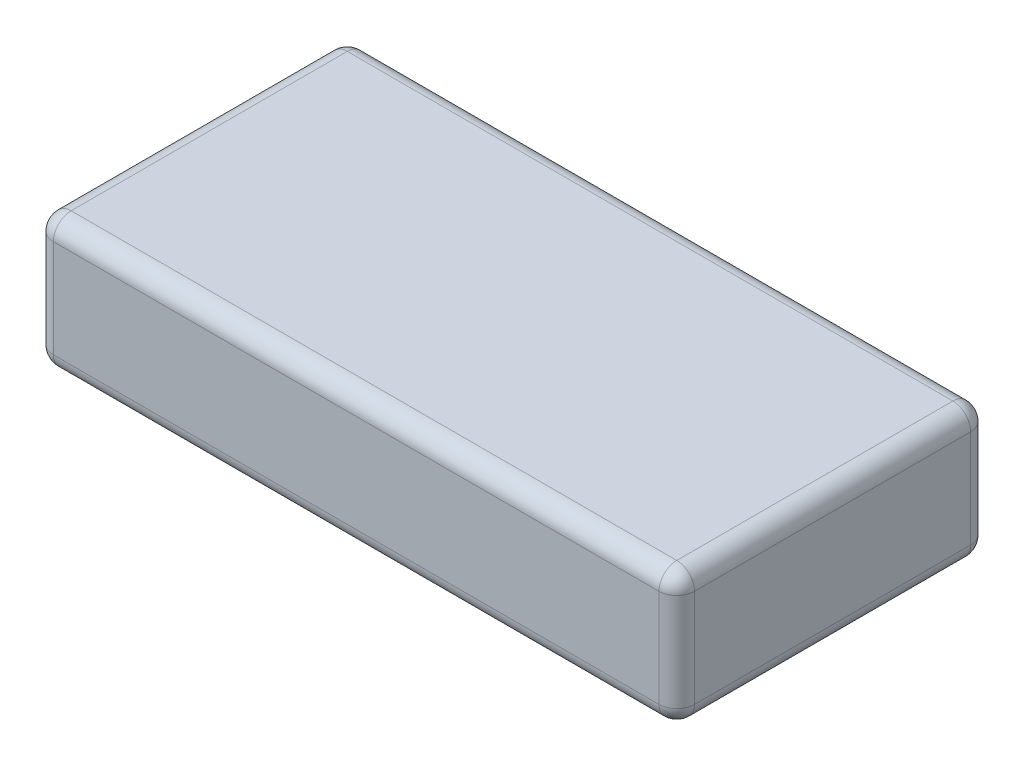
ISO-10303-21;
HEADER;
FILE_DESCRIPTION(('STEP AP214'),'2;1');
FILE_NAME('part.step','',(''),(''),'','','');
FILE_SCHEMA(('AUTOMOTIVE_DESIGN { 1 0 10303 214 1 1 1 1 }'));
ENDSEC;
DATA;
#1=APPLICATION_CONTEXT('core data for automotive mechanical design processes');
#2=APPLICATION_PROTOCOL_DEFINITION('international standard','automotive_design',2000,#1);
#3=PRODUCT_CONTEXT('',#1,'mechanical');
#4=PRODUCT('Part','Part','',(#3));
#5=PRODUCT_RELATED_PRODUCT_CATEGORY('part','',(#4));
#6=PRODUCT_DEFINITION_FORMATION('','',#4);
#7=PRODUCT_DEFINITION_CONTEXT('part definition',#1,'design');
#8=PRODUCT_DEFINITION('design','',#6,#7);
#9=PRODUCT_DEFINITION_SHAPE('','',#8);
#10=(LENGTH_UNIT() NAMED_UNIT(*) SI_UNIT(.MILLI.,.METRE.));
#11=(NAMED_UNIT(*) PLANE_ANGLE_UNIT() SI_UNIT($,.RADIAN.));
#12=(NAMED_UNIT(*) SI_UNIT($,.STERADIAN.) SOLID_ANGLE_UNIT());
#13=UNCERTAINTY_MEASURE_WITH_UNIT(LENGTH_MEASURE(1.E-05),#10,'distance_accuracy_value','');
#14=(GEOMETRIC_REPRESENTATION_CONTEXT(3) GLOBAL_UNCERTAINTY_ASSIGNED_CONTEXT((#13)) GLOBAL_UNIT_ASSIGNED_CONTEXT((#10,
#11,#12)) REPRESENTATION_CONTEXT('',''));
#15=CARTESIAN_POINT('',(0.,0.,0.));
#16=DIRECTION('',(0.,0.,1.));
#17=DIRECTION('',(1.,0.,0.));
#18=AXIS2_PLACEMENT_3D('',#15,#16,#17);
#19=CARTESIAN_POINT('',(-36.,15.,-17.5));
#20=DIRECTION('',(1.,0.,0.));
#21=DIRECTION('',(0.,0.,-1.));
#22=AXIS2_PLACEMENT_3D('',#19,#20,#21);
#23=PLANE('',#22);
#24=DIRECTION('',(0.,-1.,0.));
#25=VECTOR('',#24,1.);
#26=CARTESIAN_POINT('',(-36.,15.,-15.5));
#27=LINE('',#26,#25);
#28=CARTESIAN_POINT('',(-36.,13.,-15.5));
#29=VERTEX_POINT('',#28);
#30=CARTESIAN_POINT('',(-36.,2.,-15.5));
#31=VERTEX_POINT('',#30);
#32=EDGE_CURVE('E130',#29,#31,#27,.T.);
#33=ORIENTED_EDGE('',*,*,#32,.T.);
#34=DIRECTION('',(0.,0.,1.));
#35=VECTOR('',#34,1.);
#36=CARTESIAN_POINT('',(-36.,2.,17.5));
#37=LINE('',#36,#35);
#38=CARTESIAN_POINT('',(-36.,2.,15.5));
#39=VERTEX_POINT('',#38);
#40=EDGE_CURVE('E126',#31,#39,#37,.T.);
#41=ORIENTED_EDGE('',*,*,#40,.T.);
#42=DIRECTION('',(0.,-1.,0.));
#43=VECTOR('',#42,1.);
#44=CARTESIAN_POINT('',(-36.,15.,15.5));
#45=LINE('',#44,#43);
#46=CARTESIAN_POINT('',(-36.,13.,15.5));
#47=VERTEX_POINT('',#46);
#48=EDGE_CURVE('E121',#39,#47,#45,.F.);
#49=ORIENTED_EDGE('',*,*,#48,.T.);
#50=DIRECTION('',(0.,0.,1.));
#51=VECTOR('',#50,1.);
#52=CARTESIAN_POINT('',(-36.,13.,-17.5));
#53=LINE('',#52,#51);
#54=EDGE_CURVE('E123',#47,#29,#53,.F.);
#55=ORIENTED_EDGE('',*,*,#54,.T.);
#56=EDGE_LOOP('',(#33,#41,#49,#55));
#57=FACE_BOUND('',#56,.T.);
#58=ADVANCED_FACE('F33',(#57),#23,.F.);
#59=CARTESIAN_POINT('',(36.,15.,17.5));
#60=DIRECTION('',(0.,0.,-1.));
#61=DIRECTION('',(-1.,0.,0.));
#62=AXIS2_PLACEMENT_3D('',#59,#60,#61);
#63=PLANE('',#62);
#64=DIRECTION('',(0.,-1.,0.));
#65=VECTOR('',#64,1.);
#66=CARTESIAN_POINT('',(-34.,15.,17.5));
#67=LINE('',#66,#65);
#68=CARTESIAN_POINT('',(-34.,13.,17.5));
#69=VERTEX_POINT('',#68);
#70=CARTESIAN_POINT('',(-34.,2.,17.5));
#71=VERTEX_POINT('',#70);
#72=EDGE_CURVE('E152',#69,#71,#67,.T.);
#73=ORIENTED_EDGE('',*,*,#72,.T.);
#74=DIRECTION('',(1.,0.,0.));
#75=VECTOR('',#74,1.);
#76=CARTESIAN_POINT('',(36.,2.,17.5));
#77=LINE('',#76,#75);
#78=CARTESIAN_POINT('',(34.,2.,17.5));
#79=VERTEX_POINT('',#78);
#80=EDGE_CURVE('E230',#71,#79,#77,.T.);
#81=ORIENTED_EDGE('',*,*,#80,.T.);
#82=DIRECTION('',(0.,-1.,0.));
#83=VECTOR('',#82,1.);
#84=CARTESIAN_POINT('',(34.,15.,17.5));
#85=LINE('',#84,#83);
#86=CARTESIAN_POINT('',(34.,13.,17.5));
#87=VERTEX_POINT('',#86);
#88=EDGE_CURVE('E223',#79,#87,#85,.F.);
#89=ORIENTED_EDGE('',*,*,#88,.T.);
#90=DIRECTION('',(1.,0.,0.));
#91=VECTOR('',#90,1.);
#92=CARTESIAN_POINT('',(36.,13.,17.5));
#93=LINE('',#92,#91);
#94=EDGE_CURVE('E221',#87,#69,#93,.F.);
#95=ORIENTED_EDGE('',*,*,#94,.T.);
#96=EDGE_LOOP('',(#73,#81,#89,#95));
#97=FACE_BOUND('',#96,.T.);
#98=ADVANCED_FACE('F320',(#97),#63,.F.);
#99=CARTESIAN_POINT('',(36.,15.,-17.5));
#100=DIRECTION('',(-1.,0.,0.));
#101=DIRECTION('',(0.,0.,1.));
#102=AXIS2_PLACEMENT_3D('',#99,#100,#101);
#103=PLANE('',#102);
#104=DIRECTION('',(0.,0.,-1.));
#105=VECTOR('',#104,1.);
#106=CARTESIAN_POINT('',(36.,2.,-17.5));
#107=LINE('',#106,#105);
#108=CARTESIAN_POINT('',(36.,2.,15.5));
#109=VERTEX_POINT('',#108);
#110=CARTESIAN_POINT('',(36.,2.,-15.5));
#111=VERTEX_POINT('',#110);
#112=EDGE_CURVE('E217',#109,#111,#107,.T.);
#113=ORIENTED_EDGE('',*,*,#112,.T.);
#114=DIRECTION('',(0.,-1.,0.));
#115=VECTOR('',#114,1.);
#116=CARTESIAN_POINT('',(36.,15.,-15.5));
#117=LINE('',#116,#115);
#118=CARTESIAN_POINT('',(36.,13.,-15.5));
#119=VERTEX_POINT('',#118);
#120=EDGE_CURVE('E214',#111,#119,#117,.F.);
#121=ORIENTED_EDGE('',*,*,#120,.T.);
#122=DIRECTION('',(0.,0.,-1.));
#123=VECTOR('',#122,1.);
#124=CARTESIAN_POINT('',(36.,13.,-17.5));
#125=LINE('',#124,#123);
#126=CARTESIAN_POINT('',(36.,13.,15.5));
#127=VERTEX_POINT('',#126);
#128=EDGE_CURVE('E207',#119,#127,#125,.F.);
#129=ORIENTED_EDGE('',*,*,#128,.T.);
#130=DIRECTION('',(0.,-1.,0.));
#131=VECTOR('',#130,1.);
#132=CARTESIAN_POINT('',(36.,15.,15.5));
#133=LINE('',#132,#131);
#134=EDGE_CURVE('E210',#127,#109,#133,.T.);
#135=ORIENTED_EDGE('',*,*,#134,.T.);
#136=EDGE_LOOP('',(#113,#121,#129,#135));
#137=FACE_BOUND('',#136,.T.);
#138=ADVANCED_FACE('F215',(#137),#103,.F.);
#139=CARTESIAN_POINT('',(36.,15.,-17.5));
#140=DIRECTION('',(0.,0.,1.));
#141=DIRECTION('',(1.,0.,0.));
#142=AXIS2_PLACEMENT_3D('',#139,#140,#141);
#143=PLANE('',#142);
#144=DIRECTION('',(-1.,0.,0.));
#145=VECTOR('',#144,1.);
#146=CARTESIAN_POINT('',(-36.,2.,-17.5));
#147=LINE('',#146,#145);
#148=CARTESIAN_POINT('',(34.,2.,-17.5));
#149=VERTEX_POINT('',#148);
#150=CARTESIAN_POINT('',(-34.,2.,-17.5));
#151=VERTEX_POINT('',#150);
#152=EDGE_CURVE('E279',#149,#151,#147,.T.);
#153=ORIENTED_EDGE('',*,*,#152,.T.);
#154=DIRECTION('',(0.,-1.,0.));
#155=VECTOR('',#154,1.);
#156=CARTESIAN_POINT('',(-34.,15.,-17.5));
#157=LINE('',#156,#155);
#158=CARTESIAN_POINT('',(-34.,13.,-17.5));
#159=VERTEX_POINT('',#158);
#160=EDGE_CURVE('E211',#151,#159,#157,.F.);
#161=ORIENTED_EDGE('',*,*,#160,.T.);
#162=DIRECTION('',(-1.,0.,0.));
#163=VECTOR('',#162,1.);
#164=CARTESIAN_POINT('',(36.,13.,-17.5));
#165=LINE('',#164,#163);
#166=CARTESIAN_POINT('',(34.,13.,-17.5));
#167=VERTEX_POINT('',#166);
#168=EDGE_CURVE('E272',#159,#167,#165,.F.);
#169=ORIENTED_EDGE('',*,*,#168,.T.);
#170=DIRECTION('',(0.,-1.,0.));
#171=VECTOR('',#170,1.);
#172=CARTESIAN_POINT('',(34.,15.,-17.5));
#173=LINE('',#172,#171);
#174=EDGE_CURVE('E274',#167,#149,#173,.T.);
#175=ORIENTED_EDGE('',*,*,#174,.T.);
#176=EDGE_LOOP('',(#153,#161,#169,#175));
#177=FACE_BOUND('',#176,.T.);
#178=ADVANCED_FACE('F304',(#177),#143,.F.);
#179=CARTESIAN_POINT('',(0.,15.,0.));
#180=DIRECTION('',(0.,-1.,0.));
#181=DIRECTION('',(0.,0.,-1.));
#182=AXIS2_PLACEMENT_3D('',#179,#180,#181);
#183=PLANE('',#182);
#184=DIRECTION('',(0.,0.,-1.));
#185=VECTOR('',#184,1.);
#186=CARTESIAN_POINT('',(34.,15.,0.));
#187=LINE('',#186,#185);
#188=CARTESIAN_POINT('',(34.,15.,15.5));
#189=VERTEX_POINT('',#188);
#190=CARTESIAN_POINT('',(34.,15.,-15.5));
#191=VERTEX_POINT('',#190);
#192=EDGE_CURVE('E42',#189,#191,#187,.T.);
#193=ORIENTED_EDGE('',*,*,#192,.T.);
#194=DIRECTION('',(-1.,0.,0.));
#195=VECTOR('',#194,1.);
#196=CARTESIAN_POINT('',(0.,15.,-15.5));
#197=LINE('',#196,#195);
#198=CARTESIAN_POINT('',(-34.,15.,-15.5));
#199=VERTEX_POINT('',#198);
#200=EDGE_CURVE('E11',#191,#199,#197,.T.);
#201=ORIENTED_EDGE('',*,*,#200,.T.);
#202=DIRECTION('',(0.,0.,1.));
#203=VECTOR('',#202,1.);
#204=CARTESIAN_POINT('',(-34.,15.,0.));
#205=LINE('',#204,#203);
#206=CARTESIAN_POINT('',(-34.,15.,15.5));
#207=VERTEX_POINT('',#206);
#208=EDGE_CURVE('E232',#199,#207,#205,.T.);
#209=ORIENTED_EDGE('',*,*,#208,.T.);
#210=DIRECTION('',(1.,0.,0.));
#211=VECTOR('',#210,1.);
#212=CARTESIAN_POINT('',(0.,15.,15.5));
#213=LINE('',#212,#211);
#214=EDGE_CURVE('E53',#207,#189,#213,.T.);
#215=ORIENTED_EDGE('',*,*,#214,.T.);
#216=EDGE_LOOP('',(#193,#201,#209,#215));
#217=FACE_BOUND('',#216,.T.);
#218=ADVANCED_FACE('F483',(#217),#183,.F.);
#219=CARTESIAN_POINT('',(0.,0.,0.));
#220=DIRECTION('',(0.,-1.,0.));
#221=DIRECTION('',(0.,0.,-1.));
#222=AXIS2_PLACEMENT_3D('',#219,#220,#221);
#223=PLANE('',#222);
#224=DIRECTION('',(1.,0.,0.));
#225=VECTOR('',#224,1.);
#226=CARTESIAN_POINT('',(-36.,0.,15.5));
#227=LINE('',#226,#225);
#228=CARTESIAN_POINT('',(34.,0.,15.5));
#229=VERTEX_POINT('',#228);
#230=CARTESIAN_POINT('',(-34.,0.,15.5));
#231=VERTEX_POINT('',#230);
#232=EDGE_CURVE('E268',#229,#231,#227,.F.);
#233=ORIENTED_EDGE('',*,*,#232,.T.);
#234=DIRECTION('',(0.,0.,1.));
#235=VECTOR('',#234,1.);
#236=CARTESIAN_POINT('',(-34.,0.,-17.5));
#237=LINE('',#236,#235);
#238=CARTESIAN_POINT('',(-34.,0.,-15.5));
#239=VERTEX_POINT('',#238);
#240=EDGE_CURVE('E262',#231,#239,#237,.F.);
#241=ORIENTED_EDGE('',*,*,#240,.T.);
#242=DIRECTION('',(-1.,0.,0.));
#243=VECTOR('',#242,1.);
#244=CARTESIAN_POINT('',(36.,0.,-15.5));
#245=LINE('',#244,#243);
#246=CARTESIAN_POINT('',(34.,0.,-15.5));
#247=VERTEX_POINT('',#246);
#248=EDGE_CURVE('E256',#239,#247,#245,.F.);
#249=ORIENTED_EDGE('',*,*,#248,.T.);
#250=DIRECTION('',(0.,0.,-1.));
#251=VECTOR('',#250,1.);
#252=CARTESIAN_POINT('',(34.,0.,17.5));
#253=LINE('',#252,#251);
#254=EDGE_CURVE('E263',#247,#229,#253,.F.);
#255=ORIENTED_EDGE('',*,*,#254,.T.);
#256=EDGE_LOOP('',(#233,#241,#249,#255));
#257=FACE_BOUND('',#256,.T.);
#258=ADVANCED_FACE('F266',(#257),#223,.T.);
#259=CARTESIAN_POINT('',(34.,13.,0.));
#260=DIRECTION('',(0.,0.,-1.));
#261=DIRECTION('',(-1.,0.,0.));
#262=AXIS2_PLACEMENT_3D('',#259,#260,#261);
#263=CYLINDRICAL_SURFACE('',#262,2.);
#264=CARTESIAN_POINT('',(34.,13.,-15.5));
#265=DIRECTION('',(0.,0.,-1.));
#266=DIRECTION('',(-1.,0.,0.));
#267=AXIS2_PLACEMENT_3D('',#264,#265,#266);
#268=CIRCLE('',#267,2.);
#269=EDGE_CURVE('E37',#191,#119,#268,.T.);
#270=ORIENTED_EDGE('',*,*,#269,.F.);
#271=ORIENTED_EDGE('',*,*,#192,.F.);
#272=CARTESIAN_POINT('',(34.,13.,15.5));
#273=DIRECTION('',(0.,0.,1.));
#274=DIRECTION('',(0.,-1.,0.));
#275=AXIS2_PLACEMENT_3D('',#272,#273,#274);
#276=CIRCLE('',#275,2.);
#277=EDGE_CURVE('E192',#127,#189,#276,.T.);
#278=ORIENTED_EDGE('',*,*,#277,.F.);
#279=ORIENTED_EDGE('',*,*,#128,.F.);
#280=EDGE_LOOP('',(#270,#271,#278,#279));
#281=FACE_BOUND('',#280,.T.);
#282=ADVANCED_FACE('F35',(#281),#263,.T.);
#283=CARTESIAN_POINT('',(34.,13.,-15.5));
#284=DIRECTION('',(0.,0.,1.));
#285=DIRECTION('',(1.,0.,0.));
#286=AXIS2_PLACEMENT_3D('',#283,#284,#285);
#287=SPHERICAL_SURFACE('',#286,2.);
#288=CARTESIAN_POINT('',(34.,13.,-15.5));
#289=DIRECTION('',(1.,0.,0.));
#290=DIRECTION('',(0.,0.,-1.));
#291=AXIS2_PLACEMENT_3D('',#288,#289,#290);
#292=CIRCLE('',#291,2.);
#293=EDGE_CURVE('E188',#191,#167,#292,.F.);
#294=ORIENTED_EDGE('',*,*,#293,.F.);
#295=ORIENTED_EDGE('',*,*,#269,.T.);
#296=CARTESIAN_POINT('',(34.,13.,-15.5));
#297=DIRECTION('',(0.,1.,0.));
#298=DIRECTION('',(0.,0.,1.));
#299=AXIS2_PLACEMENT_3D('',#296,#297,#298);
#300=CIRCLE('',#299,2.);
#301=EDGE_CURVE('E191',#167,#119,#300,.F.);
#302=ORIENTED_EDGE('',*,*,#301,.F.);
#303=EDGE_LOOP('',(#294,#295,#302));
#304=FACE_BOUND('',#303,.T.);
#305=ADVANCED_FACE('F203',(#304),#287,.T.);
#306=CARTESIAN_POINT('',(34.,13.,15.5));
#307=DIRECTION('',(0.,0.,1.));
#308=DIRECTION('',(1.,0.,0.));
#309=AXIS2_PLACEMENT_3D('',#306,#307,#308);
#310=SPHERICAL_SURFACE('',#309,2.);
#311=CARTESIAN_POINT('',(34.,13.,15.5));
#312=DIRECTION('',(0.,1.,0.));
#313=DIRECTION('',(0.,0.,1.));
#314=AXIS2_PLACEMENT_3D('',#311,#312,#313);
#315=CIRCLE('',#314,2.);
#316=EDGE_CURVE('E182',#127,#87,#315,.F.);
#317=ORIENTED_EDGE('',*,*,#316,.F.);
#318=ORIENTED_EDGE('',*,*,#277,.T.);
#319=CARTESIAN_POINT('',(34.,13.,15.5));
#320=DIRECTION('',(1.,0.,0.));
#321=DIRECTION('',(0.,0.,-1.));
#322=AXIS2_PLACEMENT_3D('',#319,#320,#321);
#323=CIRCLE('',#322,2.);
#324=EDGE_CURVE('E185',#87,#189,#323,.F.);
#325=ORIENTED_EDGE('',*,*,#324,.F.);
#326=EDGE_LOOP('',(#317,#318,#325));
#327=FACE_BOUND('',#326,.T.);
#328=ADVANCED_FACE('F456',(#327),#310,.T.);
#329=CARTESIAN_POINT('',(34.,15.,-15.5));
#330=DIRECTION('',(0.,-1.,0.));
#331=DIRECTION('',(0.,0.,-1.));
#332=AXIS2_PLACEMENT_3D('',#329,#330,#331);
#333=CYLINDRICAL_SURFACE('',#332,2.);
#334=ORIENTED_EDGE('',*,*,#301,.T.);
#335=ORIENTED_EDGE('',*,*,#120,.F.);
#336=CARTESIAN_POINT('',(34.,2.,-15.5));
#337=DIRECTION('',(0.,-1.,0.));
#338=DIRECTION('',(0.,0.,-1.));
#339=AXIS2_PLACEMENT_3D('',#336,#337,#338);
#340=CIRCLE('',#339,2.);
#341=EDGE_CURVE('E176',#149,#111,#340,.T.);
#342=ORIENTED_EDGE('',*,*,#341,.F.);
#343=ORIENTED_EDGE('',*,*,#174,.F.);
#344=EDGE_LOOP('',(#334,#335,#342,#343));
#345=FACE_BOUND('',#344,.T.);
#346=ADVANCED_FACE('F306',(#345),#333,.T.);
#347=CARTESIAN_POINT('',(0.,13.,-15.5));
#348=DIRECTION('',(-1.,0.,0.));
#349=DIRECTION('',(0.,0.,1.));
#350=AXIS2_PLACEMENT_3D('',#347,#348,#349);
#351=CYLINDRICAL_SURFACE('',#350,2.);
#352=ORIENTED_EDGE('',*,*,#293,.T.);
#353=ORIENTED_EDGE('',*,*,#168,.F.);
#354=CARTESIAN_POINT('',(-34.,13.,-15.5));
#355=DIRECTION('',(-1.,0.,0.));
#356=DIRECTION('',(0.,0.,1.));
#357=AXIS2_PLACEMENT_3D('',#354,#355,#356);
#358=CIRCLE('',#357,2.);
#359=EDGE_CURVE('E173',#199,#159,#358,.T.);
#360=ORIENTED_EDGE('',*,*,#359,.F.);
#361=ORIENTED_EDGE('',*,*,#200,.F.);
#362=EDGE_LOOP('',(#352,#353,#360,#361));
#363=FACE_BOUND('',#362,.T.);
#364=ADVANCED_FACE('F440',(#363),#351,.T.);
#365=CARTESIAN_POINT('',(-34.,13.,0.));
#366=DIRECTION('',(0.,0.,1.));
#367=DIRECTION('',(1.,0.,0.));
#368=AXIS2_PLACEMENT_3D('',#365,#366,#367);
#369=CYLINDRICAL_SURFACE('',#368,2.);
#370=CARTESIAN_POINT('',(-34.,13.,15.5));
#371=DIRECTION('',(0.,0.,1.));
#372=DIRECTION('',(1.,0.,0.));
#373=AXIS2_PLACEMENT_3D('',#370,#371,#372);
#374=CIRCLE('',#373,2.);
#375=EDGE_CURVE('E137',#207,#47,#374,.T.);
#376=ORIENTED_EDGE('',*,*,#375,.F.);
#377=ORIENTED_EDGE('',*,*,#208,.F.);
#378=CARTESIAN_POINT('',(-34.,13.,-15.5));
#379=DIRECTION('',(0.,0.,-1.));
#380=DIRECTION('',(-1.,0.,0.));
#381=AXIS2_PLACEMENT_3D('',#378,#379,#380);
#382=CIRCLE('',#381,2.);
#383=EDGE_CURVE('E139',#29,#199,#382,.T.);
#384=ORIENTED_EDGE('',*,*,#383,.F.);
#385=ORIENTED_EDGE('',*,*,#54,.F.);
#386=EDGE_LOOP('',(#376,#377,#384,#385));
#387=FACE_BOUND('',#386,.T.);
#388=ADVANCED_FACE('F135',(#387),#369,.T.);
#389=CARTESIAN_POINT('',(0.,13.,15.5));
#390=DIRECTION('',(1.,0.,0.));
#391=DIRECTION('',(0.,0.,-1.));
#392=AXIS2_PLACEMENT_3D('',#389,#390,#391);
#393=CYLINDRICAL_SURFACE('',#392,2.);
#394=ORIENTED_EDGE('',*,*,#324,.T.);
#395=ORIENTED_EDGE('',*,*,#214,.F.);
#396=CARTESIAN_POINT('',(-34.,13.,15.5));
#397=DIRECTION('',(-1.,0.,0.));
#398=DIRECTION('',(0.,0.,1.));
#399=AXIS2_PLACEMENT_3D('',#396,#397,#398);
#400=CIRCLE('',#399,2.);
#401=EDGE_CURVE('E148',#69,#207,#400,.T.);
#402=ORIENTED_EDGE('',*,*,#401,.F.);
#403=ORIENTED_EDGE('',*,*,#94,.F.);
#404=EDGE_LOOP('',(#394,#395,#402,#403));
#405=FACE_BOUND('',#404,.T.);
#406=ADVANCED_FACE('F424',(#405),#393,.T.);
#407=CARTESIAN_POINT('',(34.,15.,15.5));
#408=DIRECTION('',(0.,-1.,0.));
#409=DIRECTION('',(0.,0.,-1.));
#410=AXIS2_PLACEMENT_3D('',#407,#408,#409);
#411=CYLINDRICAL_SURFACE('',#410,2.);
#412=ORIENTED_EDGE('',*,*,#316,.T.);
#413=ORIENTED_EDGE('',*,*,#88,.F.);
#414=CARTESIAN_POINT('',(34.,2.,15.5));
#415=DIRECTION('',(0.,-1.,0.));
#416=DIRECTION('',(0.,0.,-1.));
#417=AXIS2_PLACEMENT_3D('',#414,#415,#416);
#418=CIRCLE('',#417,2.);
#419=EDGE_CURVE('E168',#109,#79,#418,.T.);
#420=ORIENTED_EDGE('',*,*,#419,.F.);
#421=ORIENTED_EDGE('',*,*,#134,.F.);
#422=EDGE_LOOP('',(#412,#413,#420,#421));
#423=FACE_BOUND('',#422,.T.);
#424=ADVANCED_FACE('F290',(#423),#411,.T.);
#425=CARTESIAN_POINT('',(34.,2.,-17.5));
#426=DIRECTION('',(0.,0.,1.));
#427=DIRECTION('',(1.,0.,0.));
#428=AXIS2_PLACEMENT_3D('',#425,#426,#427);
#429=CYLINDRICAL_SURFACE('',#428,2.);
#430=CARTESIAN_POINT('',(34.,2.,-15.5));
#431=DIRECTION('',(0.,0.,-1.));
#432=DIRECTION('',(-1.,0.,0.));
#433=AXIS2_PLACEMENT_3D('',#430,#431,#432);
#434=CIRCLE('',#433,2.);
#435=EDGE_CURVE('E179',#111,#247,#434,.T.);
#436=ORIENTED_EDGE('',*,*,#435,.F.);
#437=ORIENTED_EDGE('',*,*,#112,.F.);
#438=CARTESIAN_POINT('',(34.,2.,15.5));
#439=DIRECTION('',(0.,0.,1.));
#440=DIRECTION('',(1.,0.,0.));
#441=AXIS2_PLACEMENT_3D('',#438,#439,#440);
#442=CIRCLE('',#441,2.);
#443=EDGE_CURVE('E165',#229,#109,#442,.T.);
#444=ORIENTED_EDGE('',*,*,#443,.F.);
#445=ORIENTED_EDGE('',*,*,#254,.F.);
#446=EDGE_LOOP('',(#436,#437,#444,#445));
#447=FACE_BOUND('',#446,.T.);
#448=ADVANCED_FACE('F287',(#447),#429,.T.);
#449=CARTESIAN_POINT('',(34.,2.,-15.5));
#450=DIRECTION('',(0.,0.,1.));
#451=DIRECTION('',(1.,0.,0.));
#452=AXIS2_PLACEMENT_3D('',#449,#450,#451);
#453=SPHERICAL_SURFACE('',#452,2.);
#454=ORIENTED_EDGE('',*,*,#341,.T.);
#455=ORIENTED_EDGE('',*,*,#435,.T.);
#456=CARTESIAN_POINT('',(34.,2.,-15.5));
#457=DIRECTION('',(1.,0.,0.));
#458=DIRECTION('',(0.,0.,-1.));
#459=AXIS2_PLACEMENT_3D('',#456,#457,#458);
#460=CIRCLE('',#459,2.);
#461=EDGE_CURVE('E156',#149,#247,#460,.F.);
#462=ORIENTED_EDGE('',*,*,#461,.F.);
#463=EDGE_LOOP('',(#454,#455,#462));
#464=FACE_BOUND('',#463,.T.);
#465=ADVANCED_FACE('F308',(#464),#453,.T.);
#466=CARTESIAN_POINT('',(-34.,13.,-15.5));
#467=DIRECTION('',(0.,0.,1.));
#468=DIRECTION('',(1.,0.,0.));
#469=AXIS2_PLACEMENT_3D('',#466,#467,#468);
#470=SPHERICAL_SURFACE('',#469,2.);
#471=ORIENTED_EDGE('',*,*,#383,.T.);
#472=ORIENTED_EDGE('',*,*,#359,.T.);
#473=CARTESIAN_POINT('',(-34.,13.,-15.5));
#474=DIRECTION('',(0.,1.,0.));
#475=DIRECTION('',(0.,0.,1.));
#476=AXIS2_PLACEMENT_3D('',#473,#474,#475);
#477=CIRCLE('',#476,2.);
#478=EDGE_CURVE('E153',#29,#159,#477,.F.);
#479=ORIENTED_EDGE('',*,*,#478,.F.);
#480=EDGE_LOOP('',(#471,#472,#479));
#481=FACE_BOUND('',#480,.T.);
#482=ADVANCED_FACE('F310',(#481),#470,.T.);
#483=CARTESIAN_POINT('',(-34.,13.,15.5));
#484=DIRECTION('',(0.,0.,1.));
#485=DIRECTION('',(1.,0.,0.));
#486=AXIS2_PLACEMENT_3D('',#483,#484,#485);
#487=SPHERICAL_SURFACE('',#486,2.);
#488=ORIENTED_EDGE('',*,*,#401,.T.);
#489=ORIENTED_EDGE('',*,*,#375,.T.);
#490=CARTESIAN_POINT('',(-34.,13.,15.5));
#491=DIRECTION('',(0.,1.,0.));
#492=DIRECTION('',(0.,0.,1.));
#493=AXIS2_PLACEMENT_3D('',#490,#491,#492);
#494=CIRCLE('',#493,2.);
#495=EDGE_CURVE('E145',#69,#47,#494,.F.);
#496=ORIENTED_EDGE('',*,*,#495,.F.);
#497=EDGE_LOOP('',(#488,#489,#496));
#498=FACE_BOUND('',#497,.T.);
#499=ADVANCED_FACE('F144',(#498),#487,.T.);
#500=CARTESIAN_POINT('',(34.,2.,15.5));
#501=DIRECTION('',(0.,0.,1.));
#502=DIRECTION('',(1.,0.,0.));
#503=AXIS2_PLACEMENT_3D('',#500,#501,#502);
#504=SPHERICAL_SURFACE('',#503,2.);
#505=ORIENTED_EDGE('',*,*,#443,.T.);
#506=ORIENTED_EDGE('',*,*,#419,.T.);
#507=CARTESIAN_POINT('',(34.,2.,15.5));
#508=DIRECTION('',(1.,0.,0.));
#509=DIRECTION('',(0.,0.,-1.));
#510=AXIS2_PLACEMENT_3D('',#507,#508,#509);
#511=CIRCLE('',#510,2.);
#512=EDGE_CURVE('E154',#229,#79,#511,.F.);
#513=ORIENTED_EDGE('',*,*,#512,.F.);
#514=EDGE_LOOP('',(#505,#506,#513));
#515=FACE_BOUND('',#514,.T.);
#516=ADVANCED_FACE('F292',(#515),#504,.T.);
#517=CARTESIAN_POINT('',(36.,2.,-15.5));
#518=DIRECTION('',(1.,0.,0.));
#519=DIRECTION('',(0.,0.,-1.));
#520=AXIS2_PLACEMENT_3D('',#517,#518,#519);
#521=CYLINDRICAL_SURFACE('',#520,2.);
#522=ORIENTED_EDGE('',*,*,#461,.T.);
#523=ORIENTED_EDGE('',*,*,#248,.F.);
#524=CARTESIAN_POINT('',(-34.,2.,-15.5));
#525=DIRECTION('',(-1.,0.,0.));
#526=DIRECTION('',(0.,0.,1.));
#527=AXIS2_PLACEMENT_3D('',#524,#525,#526);
#528=CIRCLE('',#527,2.);
#529=EDGE_CURVE('E159',#151,#239,#528,.T.);
#530=ORIENTED_EDGE('',*,*,#529,.F.);
#531=ORIENTED_EDGE('',*,*,#152,.F.);
#532=EDGE_LOOP('',(#522,#523,#530,#531));
#533=FACE_BOUND('',#532,.T.);
#534=ADVANCED_FACE('F258',(#533),#521,.T.);
#535=CARTESIAN_POINT('',(-34.,15.,-15.5));
#536=DIRECTION('',(0.,-1.,0.));
#537=DIRECTION('',(0.,0.,-1.));
#538=AXIS2_PLACEMENT_3D('',#535,#536,#537);
#539=CYLINDRICAL_SURFACE('',#538,2.);
#540=ORIENTED_EDGE('',*,*,#478,.T.);
#541=ORIENTED_EDGE('',*,*,#160,.F.);
#542=CARTESIAN_POINT('',(-34.,2.,-15.5));
#543=DIRECTION('',(0.,-1.,0.));
#544=DIRECTION('',(0.,0.,-1.));
#545=AXIS2_PLACEMENT_3D('',#542,#543,#544);
#546=CIRCLE('',#545,2.);
#547=EDGE_CURVE('E245',#31,#151,#546,.T.);
#548=ORIENTED_EDGE('',*,*,#547,.F.);
#549=ORIENTED_EDGE('',*,*,#32,.F.);
#550=EDGE_LOOP('',(#540,#541,#548,#549));
#551=FACE_BOUND('',#550,.T.);
#552=ADVANCED_FACE('F302',(#551),#539,.T.);
#553=CARTESIAN_POINT('',(-34.,15.,15.5));
#554=DIRECTION('',(0.,-1.,0.));
#555=DIRECTION('',(0.,0.,-1.));
#556=AXIS2_PLACEMENT_3D('',#553,#554,#555);
#557=CYLINDRICAL_SURFACE('',#556,2.);
#558=ORIENTED_EDGE('',*,*,#495,.T.);
#559=ORIENTED_EDGE('',*,*,#48,.F.);
#560=CARTESIAN_POINT('',(-34.,2.,15.5));
#561=DIRECTION('',(0.,-1.,0.));
#562=DIRECTION('',(0.,0.,-1.));
#563=AXIS2_PLACEMENT_3D('',#560,#561,#562);
#564=CIRCLE('',#563,2.);
#565=EDGE_CURVE('E242',#71,#39,#564,.T.);
#566=ORIENTED_EDGE('',*,*,#565,.F.);
#567=ORIENTED_EDGE('',*,*,#72,.F.);
#568=EDGE_LOOP('',(#558,#559,#566,#567));
#569=FACE_BOUND('',#568,.T.);
#570=ADVANCED_FACE('F150',(#569),#557,.T.);
#571=CARTESIAN_POINT('',(36.,2.,15.5));
#572=DIRECTION('',(-1.,0.,0.));
#573=DIRECTION('',(0.,0.,1.));
#574=AXIS2_PLACEMENT_3D('',#571,#572,#573);
#575=CYLINDRICAL_SURFACE('',#574,2.);
#576=ORIENTED_EDGE('',*,*,#512,.T.);
#577=ORIENTED_EDGE('',*,*,#80,.F.);
#578=CARTESIAN_POINT('',(-34.,2.,15.5));
#579=DIRECTION('',(-1.,0.,0.));
#580=DIRECTION('',(0.,0.,1.));
#581=AXIS2_PLACEMENT_3D('',#578,#579,#580);
#582=CIRCLE('',#581,2.);
#583=EDGE_CURVE('E240',#231,#71,#582,.T.);
#584=ORIENTED_EDGE('',*,*,#583,.F.);
#585=ORIENTED_EDGE('',*,*,#232,.F.);
#586=EDGE_LOOP('',(#576,#577,#584,#585));
#587=FACE_BOUND('',#586,.T.);
#588=ADVANCED_FACE('F295',(#587),#575,.T.);
#589=CARTESIAN_POINT('',(-34.,2.,-15.5));
#590=DIRECTION('',(0.,0.,1.));
#591=DIRECTION('',(1.,0.,0.));
#592=AXIS2_PLACEMENT_3D('',#589,#590,#591);
#593=SPHERICAL_SURFACE('',#592,2.);
#594=ORIENTED_EDGE('',*,*,#547,.T.);
#595=ORIENTED_EDGE('',*,*,#529,.T.);
#596=CARTESIAN_POINT('',(-34.,2.,-15.5));
#597=DIRECTION('',(0.,0.,-1.));
#598=DIRECTION('',(-1.,0.,0.));
#599=AXIS2_PLACEMENT_3D('',#596,#597,#598);
#600=CIRCLE('',#599,2.);
#601=EDGE_CURVE('E238',#31,#239,#600,.F.);
#602=ORIENTED_EDGE('',*,*,#601,.F.);
#603=EDGE_LOOP('',(#594,#595,#602));
#604=FACE_BOUND('',#603,.T.);
#605=ADVANCED_FACE('F252',(#604),#593,.T.);
#606=CARTESIAN_POINT('',(-34.,2.,15.5));
#607=DIRECTION('',(0.,0.,1.));
#608=DIRECTION('',(1.,0.,0.));
#609=AXIS2_PLACEMENT_3D('',#606,#607,#608);
#610=SPHERICAL_SURFACE('',#609,2.);
#611=ORIENTED_EDGE('',*,*,#583,.T.);
#612=ORIENTED_EDGE('',*,*,#565,.T.);
#613=CARTESIAN_POINT('',(-34.,2.,15.5));
#614=DIRECTION('',(0.,0.,1.));
#615=DIRECTION('',(1.,0.,0.));
#616=AXIS2_PLACEMENT_3D('',#613,#614,#615);
#617=CIRCLE('',#616,2.);
#618=EDGE_CURVE('E236',#231,#39,#617,.F.);
#619=ORIENTED_EDGE('',*,*,#618,.F.);
#620=EDGE_LOOP('',(#611,#612,#619));
#621=FACE_BOUND('',#620,.T.);
#622=ADVANCED_FACE('F332',(#621),#610,.T.);
#623=CARTESIAN_POINT('',(-34.,2.,-17.5));
#624=DIRECTION('',(0.,0.,-1.));
#625=DIRECTION('',(-1.,0.,0.));
#626=AXIS2_PLACEMENT_3D('',#623,#624,#625);
#627=CYLINDRICAL_SURFACE('',#626,2.);
#628=ORIENTED_EDGE('',*,*,#601,.T.);
#629=ORIENTED_EDGE('',*,*,#240,.F.);
#630=ORIENTED_EDGE('',*,*,#618,.T.);
#631=ORIENTED_EDGE('',*,*,#40,.F.);
#632=EDGE_LOOP('',(#628,#629,#630,#631));
#633=FACE_BOUND('',#632,.T.);
#634=ADVANCED_FACE('F329',(#633),#627,.T.);
#635=CLOSED_SHELL('',(#58,#98,#138,#178,#218,#258,#282,#305,#328,#346,#364,#388,#406,#424,#448,
#465,#482,#499,#516,#534,#552,#570,#588,#605,#622,#634));
#636=MANIFOLD_SOLID_BREP('B2',#635);
#637=ADVANCED_BREP_SHAPE_REPRESENTATION('',(#18,#636),#14);
#638=SHAPE_DEFINITION_REPRESENTATION(#9,#637);
ENDSEC;
END-ISO-10303-21;
